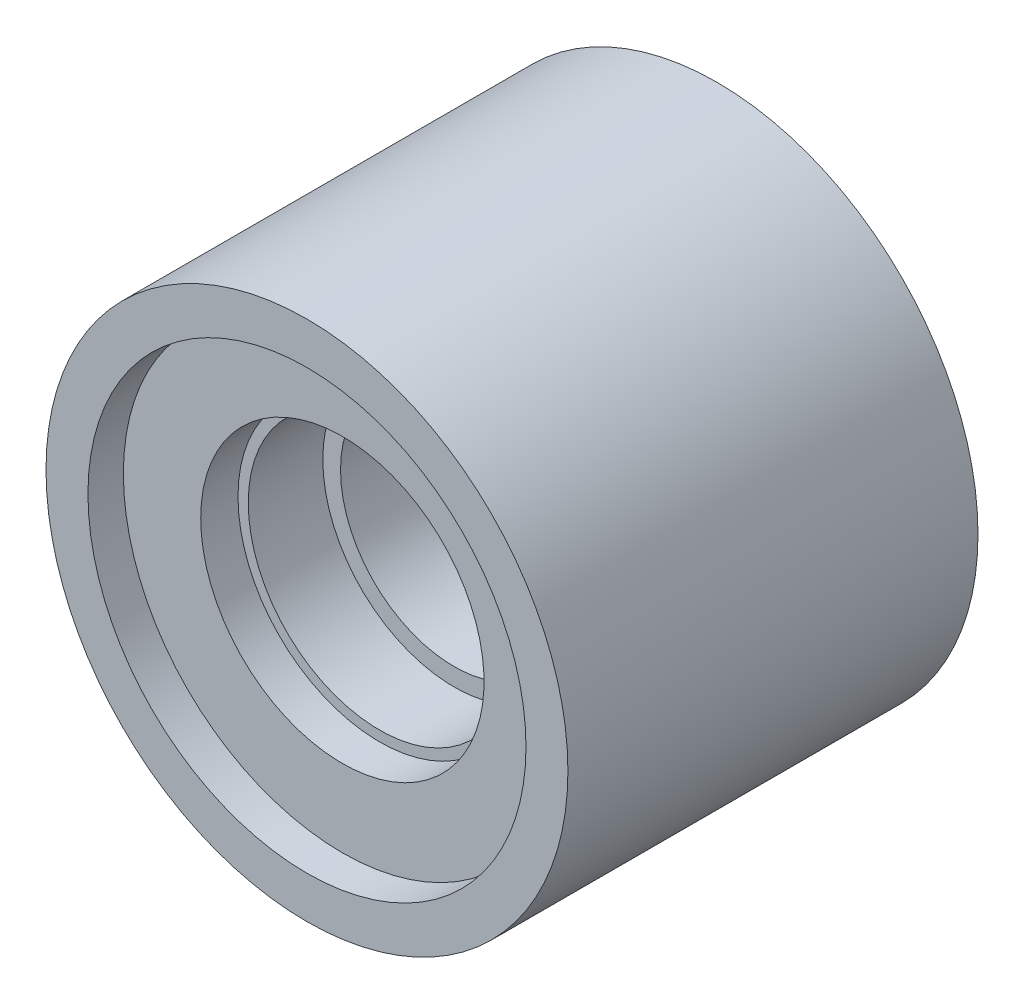
ISO-10303-21;
HEADER;
FILE_DESCRIPTION(('STEP AP214'),'2;1');
FILE_NAME('part.step','',(''),(''),'','','');
FILE_SCHEMA(('AUTOMOTIVE_DESIGN { 1 0 10303 214 1 1 1 1 }'));
ENDSEC;
DATA;
#1=APPLICATION_CONTEXT('core data for automotive mechanical design processes');
#2=APPLICATION_PROTOCOL_DEFINITION('international standard','automotive_design',2000,#1);
#3=PRODUCT_CONTEXT('',#1,'mechanical');
#4=PRODUCT('Part','Part','',(#3));
#5=PRODUCT_RELATED_PRODUCT_CATEGORY('part','',(#4));
#6=PRODUCT_DEFINITION_FORMATION('','',#4);
#7=PRODUCT_DEFINITION_CONTEXT('part definition',#1,'design');
#8=PRODUCT_DEFINITION('design','',#6,#7);
#9=PRODUCT_DEFINITION_SHAPE('','',#8);
#10=(LENGTH_UNIT() NAMED_UNIT(*) SI_UNIT(.MILLI.,.METRE.));
#11=(NAMED_UNIT(*) PLANE_ANGLE_UNIT() SI_UNIT($,.RADIAN.));
#12=(NAMED_UNIT(*) SI_UNIT($,.STERADIAN.) SOLID_ANGLE_UNIT());
#13=UNCERTAINTY_MEASURE_WITH_UNIT(LENGTH_MEASURE(1.E-05),#10,'distance_accuracy_value','');
#14=(GEOMETRIC_REPRESENTATION_CONTEXT(3) GLOBAL_UNCERTAINTY_ASSIGNED_CONTEXT((#13)) GLOBAL_UNIT_ASSIGNED_CONTEXT((#10,
#11,#12)) REPRESENTATION_CONTEXT('',''));
#15=CARTESIAN_POINT('',(0.,0.,0.));
#16=DIRECTION('',(0.,0.,1.));
#17=DIRECTION('',(1.,0.,0.));
#18=AXIS2_PLACEMENT_3D('',#15,#16,#17);
#19=CARTESIAN_POINT('',(0.,0.,22.));
#20=DIRECTION('',(0.,0.,-1.));
#21=DIRECTION('',(-1.,0.,0.));
#22=AXIS2_PLACEMENT_3D('',#19,#20,#21);
#23=CYLINDRICAL_SURFACE('',#22,14.);
#24=CARTESIAN_POINT('',(0.,0.,22.));
#25=DIRECTION('',(0.,0.,1.));
#26=DIRECTION('',(1.,0.,0.));
#27=AXIS2_PLACEMENT_3D('',#24,#25,#26);
#28=CIRCLE('',#27,14.);
#29=CARTESIAN_POINT('',(14.,0.,22.));
#30=VERTEX_POINT('',#29);
#31=EDGE_CURVE('E12',#30,#30,#28,.T.);
#32=ORIENTED_EDGE('',*,*,#31,.F.);
#33=EDGE_LOOP('',(#32));
#34=FACE_BOUND('',#33,.T.);
#35=CARTESIAN_POINT('',(0.,0.,0.));
#36=DIRECTION('',(0.,0.,1.));
#37=DIRECTION('',(1.,0.,0.));
#38=AXIS2_PLACEMENT_3D('',#35,#36,#37);
#39=CIRCLE('',#38,14.);
#40=CARTESIAN_POINT('',(14.,0.,0.));
#41=VERTEX_POINT('',#40);
#42=EDGE_CURVE('E45',#41,#41,#39,.T.);
#43=ORIENTED_EDGE('',*,*,#42,.T.);
#44=EDGE_LOOP('',(#43));
#45=FACE_BOUND('',#44,.T.);
#46=ADVANCED_FACE('F38',(#34,#45),#23,.T.);
#47=CARTESIAN_POINT('',(0.,0.,22.));
#48=DIRECTION('',(0.,0.,1.));
#49=DIRECTION('',(1.,0.,0.));
#50=AXIS2_PLACEMENT_3D('',#47,#48,#49);
#51=PLANE('',#50);
#52=CARTESIAN_POINT('',(0.,0.,22.));
#53=DIRECTION('',(0.,0.,1.));
#54=DIRECTION('',(1.,0.,0.));
#55=AXIS2_PLACEMENT_3D('',#52,#53,#54);
#56=CIRCLE('',#55,11.75);
#57=CARTESIAN_POINT('',(11.75,0.,22.));
#58=VERTEX_POINT('',#57);
#59=EDGE_CURVE('E152',#58,#58,#56,.T.);
#60=ORIENTED_EDGE('',*,*,#59,.F.);
#61=EDGE_LOOP('',(#60));
#62=FACE_BOUND('',#61,.T.);
#63=ORIENTED_EDGE('',*,*,#31,.T.);
#64=EDGE_LOOP('',(#63));
#65=FACE_BOUND('',#64,.T.);
#66=ADVANCED_FACE('F94',(#62,#65),#51,.T.);
#67=CARTESIAN_POINT('',(0.,0.,0.));
#68=DIRECTION('',(0.,0.,1.));
#69=DIRECTION('',(1.,0.,0.));
#70=AXIS2_PLACEMENT_3D('',#67,#68,#69);
#71=PLANE('',#70);
#72=CARTESIAN_POINT('',(0.,0.,0.));
#73=DIRECTION('',(0.,0.,-1.));
#74=DIRECTION('',(-1.,0.,0.));
#75=AXIS2_PLACEMENT_3D('',#72,#73,#74);
#76=CIRCLE('',#75,2.95);
#77=CARTESIAN_POINT('',(-2.95,0.,0.));
#78=VERTEX_POINT('',#77);
#79=EDGE_CURVE('E53',#78,#78,#76,.T.);
#80=ORIENTED_EDGE('',*,*,#79,.F.);
#81=EDGE_LOOP('',(#80));
#82=FACE_BOUND('',#81,.T.);
#83=ORIENTED_EDGE('',*,*,#42,.F.);
#84=EDGE_LOOP('',(#83));
#85=FACE_BOUND('',#84,.T.);
#86=ADVANCED_FACE('F91',(#82,#85),#71,.F.);
#87=CARTESIAN_POINT('',(0.,0.,1.1));
#88=DIRECTION('',(0.,0.,-1.));
#89=DIRECTION('',(-1.,0.,0.));
#90=AXIS2_PLACEMENT_3D('',#87,#88,#89);
#91=CYLINDRICAL_SURFACE('',#90,2.95);
#92=CARTESIAN_POINT('',(0.,0.,1.1));
#93=DIRECTION('',(0.,0.,-1.));
#94=DIRECTION('',(-1.,0.,0.));
#95=AXIS2_PLACEMENT_3D('',#92,#93,#94);
#96=CIRCLE('',#95,2.95);
#97=CARTESIAN_POINT('',(-2.95,0.,1.1));
#98=VERTEX_POINT('',#97);
#99=EDGE_CURVE('E50',#98,#98,#96,.T.);
#100=ORIENTED_EDGE('',*,*,#99,.F.);
#101=EDGE_LOOP('',(#100));
#102=FACE_BOUND('',#101,.T.);
#103=ORIENTED_EDGE('',*,*,#79,.T.);
#104=EDGE_LOOP('',(#103));
#105=FACE_BOUND('',#104,.T.);
#106=ADVANCED_FACE('F89',(#102,#105),#91,.F.);
#107=CARTESIAN_POINT('',(0.,0.,1.1));
#108=DIRECTION('',(0.,0.,-1.));
#109=DIRECTION('',(-1.,0.,0.));
#110=AXIS2_PLACEMENT_3D('',#107,#108,#109);
#111=PLANE('',#110);
#112=CARTESIAN_POINT('',(0.,0.,1.1));
#113=DIRECTION('',(0.,0.,-1.));
#114=DIRECTION('',(-1.,0.,0.));
#115=AXIS2_PLACEMENT_3D('',#112,#113,#114);
#116=CIRCLE('',#115,2.6);
#117=CARTESIAN_POINT('',(-2.6,0.,1.1));
#118=VERTEX_POINT('',#117);
#119=EDGE_CURVE('E81',#118,#118,#116,.T.);
#120=ORIENTED_EDGE('',*,*,#119,.F.);
#121=EDGE_LOOP('',(#120));
#122=FACE_BOUND('',#121,.T.);
#123=ORIENTED_EDGE('',*,*,#99,.T.);
#124=EDGE_LOOP('',(#123));
#125=FACE_BOUND('',#124,.T.);
#126=ADVANCED_FACE('F110',(#122,#125),#111,.T.);
#127=CARTESIAN_POINT('',(0.,0.,10.1));
#128=DIRECTION('',(0.,0.,-1.));
#129=DIRECTION('',(-1.,0.,0.));
#130=AXIS2_PLACEMENT_3D('',#127,#128,#129);
#131=CYLINDRICAL_SURFACE('',#130,2.6);
#132=CARTESIAN_POINT('',(0.,0.,10.1));
#133=DIRECTION('',(0.,0.,-1.));
#134=DIRECTION('',(-1.,0.,0.));
#135=AXIS2_PLACEMENT_3D('',#132,#133,#134);
#136=CIRCLE('',#135,2.6);
#137=CARTESIAN_POINT('',(-2.6,0.,10.1));
#138=VERTEX_POINT('',#137);
#139=EDGE_CURVE('E78',#138,#138,#136,.T.);
#140=ORIENTED_EDGE('',*,*,#139,.F.);
#141=EDGE_LOOP('',(#140));
#142=FACE_BOUND('',#141,.T.);
#143=ORIENTED_EDGE('',*,*,#119,.T.);
#144=EDGE_LOOP('',(#143));
#145=FACE_BOUND('',#144,.T.);
#146=ADVANCED_FACE('F114',(#142,#145),#131,.F.);
#147=CARTESIAN_POINT('',(0.,0.,10.1));
#148=DIRECTION('',(0.,0.,-1.));
#149=DIRECTION('',(-1.,0.,0.));
#150=AXIS2_PLACEMENT_3D('',#147,#148,#149);
#151=PLANE('',#150);
#152=ORIENTED_EDGE('',*,*,#139,.T.);
#153=EDGE_LOOP('',(#152));
#154=FACE_BOUND('',#153,.T.);
#155=CARTESIAN_POINT('',(0.,0.,10.1));
#156=DIRECTION('',(0.,0.,-1.));
#157=DIRECTION('',(-1.,0.,0.));
#158=AXIS2_PLACEMENT_3D('',#155,#156,#157);
#159=CIRCLE('',#158,6.1);
#160=CARTESIAN_POINT('',(-6.1,0.,10.1));
#161=VERTEX_POINT('',#160);
#162=EDGE_CURVE('E58',#161,#161,#159,.F.);
#163=ORIENTED_EDGE('',*,*,#162,.T.);
#164=EDGE_LOOP('',(#163));
#165=FACE_BOUND('',#164,.T.);
#166=ADVANCED_FACE('F118',(#154,#165),#151,.F.);
#167=CARTESIAN_POINT('',(0.,0.,-7.15340546095176));
#168=DIRECTION('',(0.,0.,1.));
#169=DIRECTION('',(1.,0.,0.));
#170=AXIS2_PLACEMENT_3D('',#167,#168,#169);
#171=CYLINDRICAL_SURFACE('',#170,6.1);
#172=CARTESIAN_POINT('',(0.,0.,14.1));
#173=DIRECTION('',(0.,0.,-1.));
#174=DIRECTION('',(-1.,0.,0.));
#175=AXIS2_PLACEMENT_3D('',#172,#173,#174);
#176=CIRCLE('',#175,6.1);
#177=CARTESIAN_POINT('',(-6.1,0.,14.1));
#178=VERTEX_POINT('',#177);
#179=EDGE_CURVE('E56',#178,#178,#176,.F.);
#180=ORIENTED_EDGE('',*,*,#179,.T.);
#181=EDGE_LOOP('',(#180));
#182=FACE_BOUND('',#181,.T.);
#183=ORIENTED_EDGE('',*,*,#162,.F.);
#184=EDGE_LOOP('',(#183));
#185=FACE_BOUND('',#184,.T.);
#186=ADVANCED_FACE('F122',(#182,#185),#171,.F.);
#187=CARTESIAN_POINT('',(0.,0.,14.1));
#188=DIRECTION('',(0.,0.,-1.));
#189=DIRECTION('',(-1.,0.,0.));
#190=AXIS2_PLACEMENT_3D('',#187,#188,#189);
#191=PLANE('',#190);
#192=CARTESIAN_POINT('',(0.,0.,14.1));
#193=DIRECTION('',(0.,0.,-1.));
#194=DIRECTION('',(-1.,0.,0.));
#195=AXIS2_PLACEMENT_3D('',#192,#193,#194);
#196=CIRCLE('',#195,7.05);
#197=CARTESIAN_POINT('',(-7.05,0.,14.1));
#198=VERTEX_POINT('',#197);
#199=EDGE_CURVE('E59',#198,#198,#196,.F.);
#200=ORIENTED_EDGE('',*,*,#199,.T.);
#201=EDGE_LOOP('',(#200));
#202=FACE_BOUND('',#201,.T.);
#203=ORIENTED_EDGE('',*,*,#179,.F.);
#204=EDGE_LOOP('',(#203));
#205=FACE_BOUND('',#204,.T.);
#206=ADVANCED_FACE('F126',(#202,#205),#191,.F.);
#207=CARTESIAN_POINT('',(0.,0.,-9.84041122946065));
#208=DIRECTION('',(0.,0.,1.));
#209=DIRECTION('',(1.,0.,0.));
#210=AXIS2_PLACEMENT_3D('',#207,#208,#209);
#211=CYLINDRICAL_SURFACE('',#210,7.05);
#212=CARTESIAN_POINT('',(0.,0.,18.1));
#213=DIRECTION('',(0.,0.,-1.));
#214=DIRECTION('',(-1.,0.,0.));
#215=AXIS2_PLACEMENT_3D('',#212,#213,#214);
#216=CIRCLE('',#215,7.05);
#217=CARTESIAN_POINT('',(-7.05,0.,18.1));
#218=VERTEX_POINT('',#217);
#219=EDGE_CURVE('E60',#218,#218,#216,.F.);
#220=ORIENTED_EDGE('',*,*,#219,.T.);
#221=EDGE_LOOP('',(#220));
#222=FACE_BOUND('',#221,.T.);
#223=ORIENTED_EDGE('',*,*,#199,.F.);
#224=EDGE_LOOP('',(#223));
#225=FACE_BOUND('',#224,.T.);
#226=ADVANCED_FACE('F130',(#222,#225),#211,.F.);
#227=CARTESIAN_POINT('',(0.,0.,18.1));
#228=DIRECTION('',(0.,0.,-1.));
#229=DIRECTION('',(-1.,0.,0.));
#230=AXIS2_PLACEMENT_3D('',#227,#228,#229);
#231=PLANE('',#230);
#232=CARTESIAN_POINT('',(0.,0.,18.1));
#233=DIRECTION('',(0.,0.,-1.));
#234=DIRECTION('',(-1.,0.,0.));
#235=AXIS2_PLACEMENT_3D('',#232,#233,#234);
#236=CIRCLE('',#235,7.6);
#237=CARTESIAN_POINT('',(-7.6,0.,18.1));
#238=VERTEX_POINT('',#237);
#239=EDGE_CURVE('E62',#238,#238,#236,.F.);
#240=ORIENTED_EDGE('',*,*,#239,.T.);
#241=EDGE_LOOP('',(#240));
#242=FACE_BOUND('',#241,.T.);
#243=ORIENTED_EDGE('',*,*,#219,.F.);
#244=EDGE_LOOP('',(#243));
#245=FACE_BOUND('',#244,.T.);
#246=ADVANCED_FACE('F134',(#242,#245),#231,.F.);
#247=CARTESIAN_POINT('',(0.,0.,-7.39604614807105));
#248=DIRECTION('',(0.,0.,1.));
#249=DIRECTION('',(1.,0.,0.));
#250=AXIS2_PLACEMENT_3D('',#247,#248,#249);
#251=CYLINDRICAL_SURFACE('',#250,7.6);
#252=CARTESIAN_POINT('',(0.,0.,20.1));
#253=DIRECTION('',(0.,0.,-1.));
#254=DIRECTION('',(-1.,0.,0.));
#255=AXIS2_PLACEMENT_3D('',#252,#253,#254);
#256=CIRCLE('',#255,7.6);
#257=CARTESIAN_POINT('',(-7.6,0.,20.1));
#258=VERTEX_POINT('',#257);
#259=EDGE_CURVE('E41',#258,#258,#256,.F.);
#260=ORIENTED_EDGE('',*,*,#259,.T.);
#261=EDGE_LOOP('',(#260));
#262=FACE_BOUND('',#261,.T.);
#263=ORIENTED_EDGE('',*,*,#239,.F.);
#264=EDGE_LOOP('',(#263));
#265=FACE_BOUND('',#264,.T.);
#266=ADVANCED_FACE('F137',(#262,#265),#251,.F.);
#267=CARTESIAN_POINT('',(0.,0.,20.1));
#268=DIRECTION('',(0.,0.,-1.));
#269=DIRECTION('',(-1.,0.,0.));
#270=AXIS2_PLACEMENT_3D('',#267,#268,#269);
#271=PLANE('',#270);
#272=CARTESIAN_POINT('',(0.,0.,20.1));
#273=DIRECTION('',(0.,0.,-1.));
#274=DIRECTION('',(-1.,0.,0.));
#275=AXIS2_PLACEMENT_3D('',#272,#273,#274);
#276=CIRCLE('',#275,11.75);
#277=CARTESIAN_POINT('',(-11.75,0.,20.1));
#278=VERTEX_POINT('',#277);
#279=EDGE_CURVE('E72',#278,#278,#276,.F.);
#280=ORIENTED_EDGE('',*,*,#279,.T.);
#281=EDGE_LOOP('',(#280));
#282=FACE_BOUND('',#281,.T.);
#283=ORIENTED_EDGE('',*,*,#259,.F.);
#284=EDGE_LOOP('',(#283));
#285=FACE_BOUND('',#284,.T.);
#286=ADVANCED_FACE('F140',(#282,#285),#271,.F.);
#287=CARTESIAN_POINT('',(0.,0.,-15.1340187157677));
#288=DIRECTION('',(0.,0.,1.));
#289=DIRECTION('',(1.,0.,0.));
#290=AXIS2_PLACEMENT_3D('',#287,#288,#289);
#291=CYLINDRICAL_SURFACE('',#290,11.75);
#292=ORIENTED_EDGE('',*,*,#59,.T.);
#293=EDGE_LOOP('',(#292));
#294=FACE_BOUND('',#293,.T.);
#295=ORIENTED_EDGE('',*,*,#279,.F.);
#296=EDGE_LOOP('',(#295));
#297=FACE_BOUND('',#296,.T.);
#298=ADVANCED_FACE('F144',(#294,#297),#291,.F.);
#299=CLOSED_SHELL('',(#46,#66,#86,#106,#126,#146,#166,#186,#206,#226,#246,#266,#286,#298));
#300=MANIFOLD_SOLID_BREP('B2',#299);
#301=ADVANCED_BREP_SHAPE_REPRESENTATION('',(#18,#300),#14);
#302=SHAPE_DEFINITION_REPRESENTATION(#9,#301);
ENDSEC;
END-ISO-10303-21;
